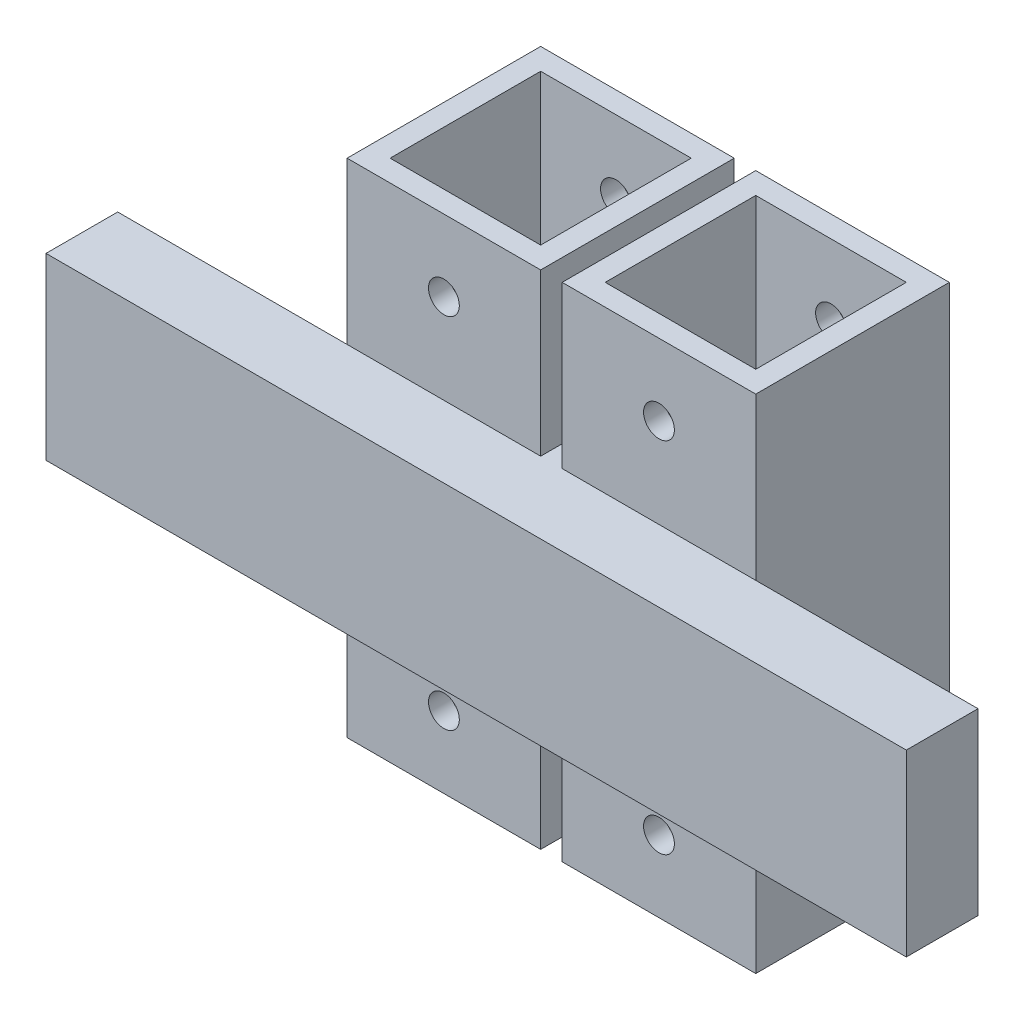
ISO-10303-21;
HEADER;
FILE_DESCRIPTION(('STEP AP214'),'2;1');
FILE_NAME('part.step','',(''),(''),'','','');
FILE_SCHEMA(('AUTOMOTIVE_DESIGN { 1 0 10303 214 1 1 1 1 }'));
ENDSEC;
DATA;
#1=APPLICATION_CONTEXT('core data for automotive mechanical design processes');
#2=APPLICATION_PROTOCOL_DEFINITION('international standard','automotive_design',2000,#1);
#3=PRODUCT_CONTEXT('',#1,'mechanical');
#4=PRODUCT('Part','Part','',(#3));
#5=PRODUCT_RELATED_PRODUCT_CATEGORY('part','',(#4));
#6=PRODUCT_DEFINITION_FORMATION('','',#4);
#7=PRODUCT_DEFINITION_CONTEXT('part definition',#1,'design');
#8=PRODUCT_DEFINITION('design','',#6,#7);
#9=PRODUCT_DEFINITION_SHAPE('','',#8);
#10=(LENGTH_UNIT() NAMED_UNIT(*) SI_UNIT(.MILLI.,.METRE.));
#11=(NAMED_UNIT(*) PLANE_ANGLE_UNIT() SI_UNIT($,.RADIAN.));
#12=(NAMED_UNIT(*) SI_UNIT($,.STERADIAN.) SOLID_ANGLE_UNIT());
#13=UNCERTAINTY_MEASURE_WITH_UNIT(LENGTH_MEASURE(1.E-05),#10,'distance_accuracy_value','');
#14=(GEOMETRIC_REPRESENTATION_CONTEXT(3) GLOBAL_UNCERTAINTY_ASSIGNED_CONTEXT((#13)) GLOBAL_UNIT_ASSIGNED_CONTEXT((#10,
#11,#12)) REPRESENTATION_CONTEXT('',''));
#15=CARTESIAN_POINT('',(0.,0.,0.));
#16=DIRECTION('',(0.,0.,1.));
#17=DIRECTION('',(1.,0.,0.));
#18=AXIS2_PLACEMENT_3D('',#15,#16,#17);
#19=CARTESIAN_POINT('',(0.,70.,0.));
#20=DIRECTION('',(1.,0.,0.));
#21=DIRECTION('',(0.,0.,-1.));
#22=AXIS2_PLACEMENT_3D('',#19,#20,#21);
#23=PLANE('',#22);
#24=DIRECTION('',(0.,-1.,0.));
#25=VECTOR('',#24,1.);
#26=CARTESIAN_POINT('',(0.,70.,0.));
#27=LINE('',#26,#25);
#28=CARTESIAN_POINT('',(0.,22.5,0.));
#29=VERTEX_POINT('',#28);
#30=CARTESIAN_POINT('',(0.,0.,0.));
#31=VERTEX_POINT('',#30);
#32=EDGE_CURVE('E332',#29,#31,#27,.T.);
#33=ORIENTED_EDGE('',*,*,#32,.F.);
#34=DIRECTION('',(0.,0.,-1.));
#35=VECTOR('',#34,1.);
#36=CARTESIAN_POINT('',(0.,22.5,25.1793566240283));
#37=LINE('',#36,#35);
#38=CARTESIAN_POINT('',(0.,22.5,-27.));
#39=VERTEX_POINT('',#38);
#40=EDGE_CURVE('E376',#29,#39,#37,.T.);
#41=ORIENTED_EDGE('',*,*,#40,.T.);
#42=DIRECTION('',(0.,-1.,0.));
#43=VECTOR('',#42,1.);
#44=CARTESIAN_POINT('',(0.,70.,-27.));
#45=LINE('',#44,#43);
#46=CARTESIAN_POINT('',(0.,0.,-27.));
#47=VERTEX_POINT('',#46);
#48=EDGE_CURVE('E312',#39,#47,#45,.T.);
#49=ORIENTED_EDGE('',*,*,#48,.T.);
#50=DIRECTION('',(0.,0.,1.));
#51=VECTOR('',#50,1.);
#52=CARTESIAN_POINT('',(0.,0.,0.));
#53=LINE('',#52,#51);
#54=EDGE_CURVE('E301',#47,#31,#53,.T.);
#55=ORIENTED_EDGE('',*,*,#54,.T.);
#56=EDGE_LOOP('',(#33,#41,#49,#55));
#57=FACE_BOUND('',#56,.T.);
#58=ADVANCED_FACE('F33',(#57),#23,.F.);
#59=CARTESIAN_POINT('',(-3.,70.,-27.));
#60=DIRECTION('',(-1.,0.,0.));
#61=DIRECTION('',(0.,0.,1.));
#62=AXIS2_PLACEMENT_3D('',#59,#60,#61);
#63=PLANE('',#62);
#64=DIRECTION('',(0.,-1.,0.));
#65=VECTOR('',#64,1.);
#66=CARTESIAN_POINT('',(-3.,70.,-27.));
#67=LINE('',#66,#65);
#68=CARTESIAN_POINT('',(-3.,22.5,-27.));
#69=VERTEX_POINT('',#68);
#70=CARTESIAN_POINT('',(-3.,0.,-27.));
#71=VERTEX_POINT('',#70);
#72=EDGE_CURVE('E216',#69,#71,#67,.T.);
#73=ORIENTED_EDGE('',*,*,#72,.F.);
#74=DIRECTION('',(0.,0.,-1.));
#75=VECTOR('',#74,1.);
#76=CARTESIAN_POINT('',(-3.,22.5,25.1793566240283));
#77=LINE('',#76,#75);
#78=CARTESIAN_POINT('',(-3.,22.5,0.));
#79=VERTEX_POINT('',#78);
#80=EDGE_CURVE('E210',#79,#69,#77,.T.);
#81=ORIENTED_EDGE('',*,*,#80,.F.);
#82=DIRECTION('',(0.,-1.,0.));
#83=VECTOR('',#82,1.);
#84=CARTESIAN_POINT('',(-3.,70.,0.));
#85=LINE('',#84,#83);
#86=CARTESIAN_POINT('',(-3.,0.,0.));
#87=VERTEX_POINT('',#86);
#88=EDGE_CURVE('E214',#79,#87,#85,.T.);
#89=ORIENTED_EDGE('',*,*,#88,.T.);
#90=DIRECTION('',(0.,0.,-1.));
#91=VECTOR('',#90,1.);
#92=CARTESIAN_POINT('',(-3.,0.,-27.));
#93=LINE('',#92,#91);
#94=EDGE_CURVE('E427',#87,#71,#93,.T.);
#95=ORIENTED_EDGE('',*,*,#94,.T.);
#96=EDGE_LOOP('',(#73,#81,#89,#95));
#97=FACE_BOUND('',#96,.T.);
#98=ADVANCED_FACE('F212',(#97),#63,.F.);
#99=CARTESIAN_POINT('',(0.,0.,0.));
#100=DIRECTION('',(0.,0.,1.));
#101=DIRECTION('',(1.,0.,0.));
#102=AXIS2_PLACEMENT_3D('',#99,#100,#101);
#103=PLANE('',#102);
#104=DIRECTION('',(0.,-1.,0.));
#105=VECTOR('',#104,1.);
#106=CARTESIAN_POINT('',(-30.,70.,0.));
#107=LINE('',#106,#105);
#108=CARTESIAN_POINT('',(-30.,47.5,0.));
#109=VERTEX_POINT('',#108);
#110=CARTESIAN_POINT('',(-30.,22.5,0.));
#111=VERTEX_POINT('',#110);
#112=EDGE_CURVE('E241',#109,#111,#107,.T.);
#113=ORIENTED_EDGE('',*,*,#112,.T.);
#114=DIRECTION('',(1.,0.,0.));
#115=VECTOR('',#114,1.);
#116=CARTESIAN_POINT('',(-62.,22.5,0.));
#117=LINE('',#116,#115);
#118=CARTESIAN_POINT('',(-62.,22.5,0.));
#119=VERTEX_POINT('',#118);
#120=EDGE_CURVE('E235',#119,#111,#117,.T.);
#121=ORIENTED_EDGE('',*,*,#120,.F.);
#122=DIRECTION('',(0.,-1.,0.));
#123=VECTOR('',#122,1.);
#124=CARTESIAN_POINT('',(-62.,47.5,0.));
#125=LINE('',#124,#123);
#126=CARTESIAN_POINT('',(-62.,47.5,0.));
#127=VERTEX_POINT('',#126);
#128=EDGE_CURVE('E236',#127,#119,#125,.T.);
#129=ORIENTED_EDGE('',*,*,#128,.F.);
#130=DIRECTION('',(-1.,0.,0.));
#131=VECTOR('',#130,1.);
#132=CARTESIAN_POINT('',(-62.,47.5,0.));
#133=LINE('',#132,#131);
#134=EDGE_CURVE('E257',#109,#127,#133,.T.);
#135=ORIENTED_EDGE('',*,*,#134,.F.);
#136=EDGE_LOOP('',(#113,#121,#129,#135));
#137=FACE_BOUND('',#136,.T.);
#138=ADVANCED_FACE('F440',(#137),#103,.F.);
#139=CARTESIAN_POINT('',(0.,70.,0.));
#140=DIRECTION('',(0.,0.,-1.));
#141=DIRECTION('',(-1.,0.,0.));
#142=AXIS2_PLACEMENT_3D('',#139,#140,#141);
#143=PLANE('',#142);
#144=CARTESIAN_POINT('',(13.5,60.,0.));
#145=DIRECTION('',(0.,0.,-1.));
#146=DIRECTION('',(-1.,0.,0.));
#147=AXIS2_PLACEMENT_3D('',#144,#145,#146);
#148=CIRCLE('',#147,2.15);
#149=CARTESIAN_POINT('',(11.35,60.,0.));
#150=VERTEX_POINT('',#149);
#151=EDGE_CURVE('E353',#150,#150,#148,.T.);
#152=ORIENTED_EDGE('',*,*,#151,.T.);
#153=EDGE_LOOP('',(#152));
#154=FACE_BOUND('',#153,.T.);
#155=CARTESIAN_POINT('',(27.,47.5,0.));
#156=VERTEX_POINT('',#155);
#157=CARTESIAN_POINT('',(0.,47.5,0.));
#158=VERTEX_POINT('',#157);
#159=EDGE_CURVE('E11',#156,#158,#133,.T.);
#160=ORIENTED_EDGE('',*,*,#159,.F.);
#161=DIRECTION('',(0.,-1.,0.));
#162=VECTOR('',#161,1.);
#163=CARTESIAN_POINT('',(27.,70.,0.));
#164=LINE('',#163,#162);
#165=CARTESIAN_POINT('',(27.,70.,0.));
#166=VERTEX_POINT('',#165);
#167=EDGE_CURVE('E329',#166,#156,#164,.T.);
#168=ORIENTED_EDGE('',*,*,#167,.F.);
#169=DIRECTION('',(1.,0.,0.));
#170=VECTOR('',#169,1.);
#171=CARTESIAN_POINT('',(0.,70.,0.));
#172=LINE('',#171,#170);
#173=CARTESIAN_POINT('',(0.,70.,0.));
#174=VERTEX_POINT('',#173);
#175=EDGE_CURVE('E305',#174,#166,#172,.T.);
#176=ORIENTED_EDGE('',*,*,#175,.F.);
#177=EDGE_CURVE('E334',#174,#158,#27,.T.);
#178=ORIENTED_EDGE('',*,*,#177,.T.);
#179=EDGE_LOOP('',(#160,#168,#176,#178));
#180=FACE_BOUND('',#179,.T.);
#181=ADVANCED_FACE('F539',(#154,#180),#143,.F.);
#182=CARTESIAN_POINT('',(13.5,10.,0.));
#183=DIRECTION('',(0.,0.,-1.));
#184=DIRECTION('',(-1.,0.,0.));
#185=AXIS2_PLACEMENT_3D('',#182,#183,#184);
#186=CIRCLE('',#185,2.15);
#187=CARTESIAN_POINT('',(11.35,10.,0.));
#188=VERTEX_POINT('',#187);
#189=EDGE_CURVE('E368',#188,#188,#186,.T.);
#190=ORIENTED_EDGE('',*,*,#189,.T.);
#191=EDGE_LOOP('',(#190));
#192=FACE_BOUND('',#191,.T.);
#193=CARTESIAN_POINT('',(27.,22.5,0.));
#194=VERTEX_POINT('',#193);
#195=EDGE_CURVE('E42',#29,#194,#117,.T.);
#196=ORIENTED_EDGE('',*,*,#195,.F.);
#197=ORIENTED_EDGE('',*,*,#32,.T.);
#198=DIRECTION('',(1.,0.,0.));
#199=VECTOR('',#198,1.);
#200=CARTESIAN_POINT('',(0.,0.,0.));
#201=LINE('',#200,#199);
#202=CARTESIAN_POINT('',(27.,0.,0.));
#203=VERTEX_POINT('',#202);
#204=EDGE_CURVE('E315',#31,#203,#201,.T.);
#205=ORIENTED_EDGE('',*,*,#204,.T.);
#206=EDGE_CURVE('E328',#194,#203,#164,.T.);
#207=ORIENTED_EDGE('',*,*,#206,.F.);
#208=EDGE_LOOP('',(#196,#197,#205,#207));
#209=FACE_BOUND('',#208,.T.);
#210=ADVANCED_FACE('F485',(#192,#209),#143,.F.);
#211=CARTESIAN_POINT('',(0.,70.,0.));
#212=DIRECTION('',(0.,-1.,0.));
#213=DIRECTION('',(0.,0.,-1.));
#214=AXIS2_PLACEMENT_3D('',#211,#212,#213);
#215=PLANE('',#214);
#216=DIRECTION('',(0.,0.,1.));
#217=VECTOR('',#216,1.);
#218=CARTESIAN_POINT('',(0.,70.,0.));
#219=LINE('',#218,#217);
#220=CARTESIAN_POINT('',(0.,70.,-27.));
#221=VERTEX_POINT('',#220);
#222=EDGE_CURVE('E302',#221,#174,#219,.T.);
#223=ORIENTED_EDGE('',*,*,#222,.T.);
#224=ORIENTED_EDGE('',*,*,#175,.T.);
#225=DIRECTION('',(0.,0.,-1.));
#226=VECTOR('',#225,1.);
#227=CARTESIAN_POINT('',(27.,70.,0.));
#228=LINE('',#227,#226);
#229=CARTESIAN_POINT('',(27.,70.,-27.));
#230=VERTEX_POINT('',#229);
#231=EDGE_CURVE('E308',#166,#230,#228,.T.);
#232=ORIENTED_EDGE('',*,*,#231,.T.);
#233=DIRECTION('',(-1.,0.,0.));
#234=VECTOR('',#233,1.);
#235=CARTESIAN_POINT('',(0.,70.,-27.));
#236=LINE('',#235,#234);
#237=EDGE_CURVE('E310',#230,#221,#236,.T.);
#238=ORIENTED_EDGE('',*,*,#237,.T.);
#239=EDGE_LOOP('',(#223,#224,#232,#238));
#240=FACE_BOUND('',#239,.T.);
#241=DIRECTION('',(0.,0.,1.));
#242=VECTOR('',#241,1.);
#243=CARTESIAN_POINT('',(3.,70.,-24.));
#244=LINE('',#243,#242);
#245=CARTESIAN_POINT('',(3.,70.,-24.));
#246=VERTEX_POINT('',#245);
#247=CARTESIAN_POINT('',(3.,70.,-3.));
#248=VERTEX_POINT('',#247);
#249=EDGE_CURVE('E271',#246,#248,#244,.T.);
#250=ORIENTED_EDGE('',*,*,#249,.F.);
#251=DIRECTION('',(-1.,0.,0.));
#252=VECTOR('',#251,1.);
#253=CARTESIAN_POINT('',(3.,70.,-24.));
#254=LINE('',#253,#252);
#255=CARTESIAN_POINT('',(24.,70.,-24.));
#256=VERTEX_POINT('',#255);
#257=EDGE_CURVE('E279',#256,#246,#254,.T.);
#258=ORIENTED_EDGE('',*,*,#257,.F.);
#259=DIRECTION('',(0.,0.,-1.));
#260=VECTOR('',#259,1.);
#261=CARTESIAN_POINT('',(24.,70.,-24.));
#262=LINE('',#261,#260);
#263=CARTESIAN_POINT('',(24.,70.,-3.00000000000001));
#264=VERTEX_POINT('',#263);
#265=EDGE_CURVE('E276',#264,#256,#262,.T.);
#266=ORIENTED_EDGE('',*,*,#265,.F.);
#267=DIRECTION('',(1.,0.,0.));
#268=VECTOR('',#267,1.);
#269=CARTESIAN_POINT('',(3.,70.,-3.));
#270=LINE('',#269,#268);
#271=EDGE_CURVE('E273',#248,#264,#270,.T.);
#272=ORIENTED_EDGE('',*,*,#271,.F.);
#273=EDGE_LOOP('',(#250,#258,#266,#272));
#274=FACE_BOUND('',#273,.T.);
#275=ADVANCED_FACE('F466',(#240,#274),#215,.F.);
#276=CARTESIAN_POINT('',(0.,0.,0.));
#277=DIRECTION('',(0.,-1.,0.));
#278=DIRECTION('',(0.,0.,-1.));
#279=AXIS2_PLACEMENT_3D('',#276,#277,#278);
#280=PLANE('',#279);
#281=ORIENTED_EDGE('',*,*,#54,.F.);
#282=DIRECTION('',(-1.,0.,0.));
#283=VECTOR('',#282,1.);
#284=CARTESIAN_POINT('',(0.,0.,-27.));
#285=LINE('',#284,#283);
#286=CARTESIAN_POINT('',(27.,0.,-27.));
#287=VERTEX_POINT('',#286);
#288=EDGE_CURVE('E306',#287,#47,#285,.T.);
#289=ORIENTED_EDGE('',*,*,#288,.F.);
#290=DIRECTION('',(0.,0.,-1.));
#291=VECTOR('',#290,1.);
#292=CARTESIAN_POINT('',(27.,0.,0.));
#293=LINE('',#292,#291);
#294=EDGE_CURVE('E318',#203,#287,#293,.T.);
#295=ORIENTED_EDGE('',*,*,#294,.F.);
#296=ORIENTED_EDGE('',*,*,#204,.F.);
#297=EDGE_LOOP('',(#281,#289,#295,#296));
#298=FACE_BOUND('',#297,.T.);
#299=DIRECTION('',(-1.,0.,0.));
#300=VECTOR('',#299,1.);
#301=CARTESIAN_POINT('',(3.,0.,-24.));
#302=LINE('',#301,#300);
#303=CARTESIAN_POINT('',(24.,0.,-24.));
#304=VERTEX_POINT('',#303);
#305=CARTESIAN_POINT('',(3.,0.,-24.));
#306=VERTEX_POINT('',#305);
#307=EDGE_CURVE('E274',#304,#306,#302,.T.);
#308=ORIENTED_EDGE('',*,*,#307,.T.);
#309=DIRECTION('',(0.,0.,1.));
#310=VECTOR('',#309,1.);
#311=CARTESIAN_POINT('',(3.,0.,-24.));
#312=LINE('',#311,#310);
#313=CARTESIAN_POINT('',(3.,0.,-3.));
#314=VERTEX_POINT('',#313);
#315=EDGE_CURVE('E270',#306,#314,#312,.T.);
#316=ORIENTED_EDGE('',*,*,#315,.T.);
#317=DIRECTION('',(1.,0.,0.));
#318=VECTOR('',#317,1.);
#319=CARTESIAN_POINT('',(3.,0.,-3.));
#320=LINE('',#319,#318);
#321=CARTESIAN_POINT('',(24.,0.,-3.00000000000001));
#322=VERTEX_POINT('',#321);
#323=EDGE_CURVE('E284',#314,#322,#320,.T.);
#324=ORIENTED_EDGE('',*,*,#323,.T.);
#325=DIRECTION('',(0.,0.,-1.));
#326=VECTOR('',#325,1.);
#327=CARTESIAN_POINT('',(24.,0.,-24.));
#328=LINE('',#327,#326);
#329=EDGE_CURVE('E287',#322,#304,#328,.T.);
#330=ORIENTED_EDGE('',*,*,#329,.T.);
#331=EDGE_LOOP('',(#308,#316,#324,#330));
#332=FACE_BOUND('',#331,.T.);
#333=ADVANCED_FACE('F476',(#298,#332),#280,.T.);
#334=CARTESIAN_POINT('',(0.,47.5,-27.));
#335=VERTEX_POINT('',#334);
#336=EDGE_CURVE('E322',#221,#335,#45,.T.);
#337=ORIENTED_EDGE('',*,*,#336,.T.);
#338=DIRECTION('',(0.,0.,-1.));
#339=VECTOR('',#338,1.);
#340=CARTESIAN_POINT('',(0.,47.5,25.1793566240283));
#341=LINE('',#340,#339);
#342=EDGE_CURVE('E374',#158,#335,#341,.T.);
#343=ORIENTED_EDGE('',*,*,#342,.F.);
#344=ORIENTED_EDGE('',*,*,#177,.F.);
#345=ORIENTED_EDGE('',*,*,#222,.F.);
#346=EDGE_LOOP('',(#337,#343,#344,#345));
#347=FACE_BOUND('',#346,.T.);
#348=ADVANCED_FACE('F35',(#347),#23,.F.);
#349=CARTESIAN_POINT('',(27.,70.,0.));
#350=DIRECTION('',(-1.,0.,0.));
#351=DIRECTION('',(0.,0.,1.));
#352=AXIS2_PLACEMENT_3D('',#349,#350,#351);
#353=PLANE('',#352);
#354=ORIENTED_EDGE('',*,*,#294,.T.);
#355=DIRECTION('',(0.,-1.,0.));
#356=VECTOR('',#355,1.);
#357=CARTESIAN_POINT('',(27.,70.,-27.));
#358=LINE('',#357,#356);
#359=EDGE_CURVE('E325',#230,#287,#358,.T.);
#360=ORIENTED_EDGE('',*,*,#359,.F.);
#361=ORIENTED_EDGE('',*,*,#231,.F.);
#362=ORIENTED_EDGE('',*,*,#167,.T.);
#363=EDGE_CURVE('E333',#156,#194,#164,.T.);
#364=ORIENTED_EDGE('',*,*,#363,.T.);
#365=ORIENTED_EDGE('',*,*,#206,.T.);
#366=EDGE_LOOP('',(#354,#360,#361,#362,#364,#365));
#367=FACE_BOUND('',#366,.T.);
#368=ADVANCED_FACE('F523',(#367),#353,.F.);
#369=CARTESIAN_POINT('',(0.,70.,-27.));
#370=DIRECTION('',(0.,0.,1.));
#371=DIRECTION('',(1.,0.,0.));
#372=AXIS2_PLACEMENT_3D('',#369,#370,#371);
#373=PLANE('',#372);
#374=CARTESIAN_POINT('',(-16.5,60.,-27.));
#375=DIRECTION('',(0.,0.,-1.));
#376=DIRECTION('',(-1.,0.,0.));
#377=AXIS2_PLACEMENT_3D('',#374,#375,#376);
#378=CIRCLE('',#377,2.14999999999999);
#379=CARTESIAN_POINT('',(-18.65,60.,-27.));
#380=VERTEX_POINT('',#379);
#381=EDGE_CURVE('E579',#380,#380,#378,.T.);
#382=ORIENTED_EDGE('',*,*,#381,.F.);
#383=EDGE_LOOP('',(#382));
#384=FACE_BOUND('',#383,.T.);
#385=CARTESIAN_POINT('',(13.5,10.,-27.));
#386=DIRECTION('',(0.,0.,-1.));
#387=DIRECTION('',(-1.,0.,0.));
#388=AXIS2_PLACEMENT_3D('',#385,#386,#387);
#389=CIRCLE('',#388,2.15);
#390=CARTESIAN_POINT('',(11.35,10.,-27.));
#391=VERTEX_POINT('',#390);
#392=EDGE_CURVE('E582',#391,#391,#389,.T.);
#393=ORIENTED_EDGE('',*,*,#392,.F.);
#394=EDGE_LOOP('',(#393));
#395=FACE_BOUND('',#394,.T.);
#396=CARTESIAN_POINT('',(-16.5,10.,-27.));
#397=DIRECTION('',(0.,0.,-1.));
#398=DIRECTION('',(-1.,0.,0.));
#399=AXIS2_PLACEMENT_3D('',#396,#397,#398);
#400=CIRCLE('',#399,2.15);
#401=CARTESIAN_POINT('',(-18.65,10.,-27.));
#402=VERTEX_POINT('',#401);
#403=EDGE_CURVE('E611',#402,#402,#400,.T.);
#404=ORIENTED_EDGE('',*,*,#403,.F.);
#405=EDGE_LOOP('',(#404));
#406=FACE_BOUND('',#405,.T.);
#407=CARTESIAN_POINT('',(13.5,60.,-27.));
#408=DIRECTION('',(0.,0.,-1.));
#409=DIRECTION('',(-1.,0.,0.));
#410=AXIS2_PLACEMENT_3D('',#407,#408,#409);
#411=CIRCLE('',#410,2.15);
#412=CARTESIAN_POINT('',(11.35,60.,-27.));
#413=VERTEX_POINT('',#412);
#414=EDGE_CURVE('E341',#413,#413,#411,.T.);
#415=ORIENTED_EDGE('',*,*,#414,.F.);
#416=EDGE_LOOP('',(#415));
#417=FACE_BOUND('',#416,.T.);
#418=ORIENTED_EDGE('',*,*,#288,.T.);
#419=ORIENTED_EDGE('',*,*,#48,.F.);
#420=DIRECTION('',(-1.,0.,0.));
#421=VECTOR('',#420,1.);
#422=CARTESIAN_POINT('',(0.,22.5,-27.));
#423=LINE('',#422,#421);
#424=EDGE_CURVE('E52',#39,#69,#423,.T.);
#425=ORIENTED_EDGE('',*,*,#424,.T.);
#426=ORIENTED_EDGE('',*,*,#72,.T.);
#427=DIRECTION('',(-1.,0.,0.));
#428=VECTOR('',#427,1.);
#429=CARTESIAN_POINT('',(-30.,0.,-27.));
#430=LINE('',#429,#428);
#431=CARTESIAN_POINT('',(-30.,0.,-27.));
#432=VERTEX_POINT('',#431);
#433=EDGE_CURVE('E417',#71,#432,#430,.T.);
#434=ORIENTED_EDGE('',*,*,#433,.T.);
#435=DIRECTION('',(0.,-1.,0.));
#436=VECTOR('',#435,1.);
#437=CARTESIAN_POINT('',(-30.,70.,-27.));
#438=LINE('',#437,#436);
#439=CARTESIAN_POINT('',(-30.,70.,-27.));
#440=VERTEX_POINT('',#439);
#441=EDGE_CURVE('E423',#440,#432,#438,.T.);
#442=ORIENTED_EDGE('',*,*,#441,.F.);
#443=DIRECTION('',(-1.,0.,0.));
#444=VECTOR('',#443,1.);
#445=CARTESIAN_POINT('',(-30.,70.,-27.));
#446=LINE('',#445,#444);
#447=CARTESIAN_POINT('',(-3.,70.,-27.));
#448=VERTEX_POINT('',#447);
#449=EDGE_CURVE('E421',#448,#440,#446,.T.);
#450=ORIENTED_EDGE('',*,*,#449,.F.);
#451=CARTESIAN_POINT('',(-3.,47.5,-27.));
#452=VERTEX_POINT('',#451);
#453=EDGE_CURVE('E230',#448,#452,#67,.T.);
#454=ORIENTED_EDGE('',*,*,#453,.T.);
#455=DIRECTION('',(1.,0.,0.));
#456=VECTOR('',#455,1.);
#457=CARTESIAN_POINT('',(0.,47.5,-27.));
#458=LINE('',#457,#456);
#459=EDGE_CURVE('E220',#452,#335,#458,.T.);
#460=ORIENTED_EDGE('',*,*,#459,.T.);
#461=ORIENTED_EDGE('',*,*,#336,.F.);
#462=ORIENTED_EDGE('',*,*,#237,.F.);
#463=ORIENTED_EDGE('',*,*,#359,.T.);
#464=EDGE_LOOP('',(#418,#419,#425,#426,#434,#442,#450,#454,#460,#461,#462,#463));
#465=FACE_BOUND('',#464,.T.);
#466=ADVANCED_FACE('F452',(#384,#395,#406,#417,#465),#373,.F.);
#467=CARTESIAN_POINT('',(3.,70.,-24.));
#468=DIRECTION('',(1.,0.,0.));
#469=DIRECTION('',(0.,0.,-1.));
#470=AXIS2_PLACEMENT_3D('',#467,#468,#469);
#471=PLANE('',#470);
#472=ORIENTED_EDGE('',*,*,#315,.F.);
#473=DIRECTION('',(0.,-1.,0.));
#474=VECTOR('',#473,1.);
#475=CARTESIAN_POINT('',(3.,70.,-24.));
#476=LINE('',#475,#474);
#477=EDGE_CURVE('E281',#246,#306,#476,.T.);
#478=ORIENTED_EDGE('',*,*,#477,.F.);
#479=ORIENTED_EDGE('',*,*,#249,.T.);
#480=DIRECTION('',(0.,-1.,0.));
#481=VECTOR('',#480,1.);
#482=CARTESIAN_POINT('',(3.,70.,-3.));
#483=LINE('',#482,#481);
#484=EDGE_CURVE('E298',#248,#314,#483,.T.);
#485=ORIENTED_EDGE('',*,*,#484,.T.);
#486=EDGE_LOOP('',(#472,#478,#479,#485));
#487=FACE_BOUND('',#486,.T.);
#488=ADVANCED_FACE('F537',(#487),#471,.T.);
#489=CARTESIAN_POINT('',(3.,70.,-3.));
#490=DIRECTION('',(0.,0.,-1.));
#491=DIRECTION('',(-1.,0.,0.));
#492=AXIS2_PLACEMENT_3D('',#489,#490,#491);
#493=PLANE('',#492);
#494=CARTESIAN_POINT('',(13.5,10.,-3.00000000000001));
#495=DIRECTION('',(0.,0.,-1.));
#496=DIRECTION('',(-1.,0.,0.));
#497=AXIS2_PLACEMENT_3D('',#494,#495,#496);
#498=CIRCLE('',#497,2.15);
#499=CARTESIAN_POINT('',(11.35,10.,-3.00000000000001));
#500=VERTEX_POINT('',#499);
#501=EDGE_CURVE('E365',#500,#500,#498,.T.);
#502=ORIENTED_EDGE('',*,*,#501,.F.);
#503=EDGE_LOOP('',(#502));
#504=FACE_BOUND('',#503,.T.);
#505=CARTESIAN_POINT('',(13.5,60.,-3.00000000000001));
#506=DIRECTION('',(0.,0.,-1.));
#507=DIRECTION('',(-1.,0.,0.));
#508=AXIS2_PLACEMENT_3D('',#505,#506,#507);
#509=CIRCLE('',#508,2.15);
#510=CARTESIAN_POINT('',(11.35,60.,-3.00000000000001));
#511=VERTEX_POINT('',#510);
#512=EDGE_CURVE('E348',#511,#511,#509,.T.);
#513=ORIENTED_EDGE('',*,*,#512,.F.);
#514=EDGE_LOOP('',(#513));
#515=FACE_BOUND('',#514,.T.);
#516=ORIENTED_EDGE('',*,*,#323,.F.);
#517=ORIENTED_EDGE('',*,*,#484,.F.);
#518=ORIENTED_EDGE('',*,*,#271,.T.);
#519=DIRECTION('',(0.,-1.,0.));
#520=VECTOR('',#519,1.);
#521=CARTESIAN_POINT('',(24.,70.,-3.00000000000001));
#522=LINE('',#521,#520);
#523=EDGE_CURVE('E296',#264,#322,#522,.T.);
#524=ORIENTED_EDGE('',*,*,#523,.T.);
#525=EDGE_LOOP('',(#516,#517,#518,#524));
#526=FACE_BOUND('',#525,.T.);
#527=ADVANCED_FACE('F791',(#504,#515,#526),#493,.T.);
#528=CARTESIAN_POINT('',(24.,70.,-24.));
#529=DIRECTION('',(-1.,0.,0.));
#530=DIRECTION('',(0.,0.,1.));
#531=AXIS2_PLACEMENT_3D('',#528,#529,#530);
#532=PLANE('',#531);
#533=ORIENTED_EDGE('',*,*,#329,.F.);
#534=ORIENTED_EDGE('',*,*,#523,.F.);
#535=ORIENTED_EDGE('',*,*,#265,.T.);
#536=DIRECTION('',(0.,-1.,0.));
#537=VECTOR('',#536,1.);
#538=CARTESIAN_POINT('',(24.,70.,-24.));
#539=LINE('',#538,#537);
#540=EDGE_CURVE('E294',#256,#304,#539,.T.);
#541=ORIENTED_EDGE('',*,*,#540,.T.);
#542=EDGE_LOOP('',(#533,#534,#535,#541));
#543=FACE_BOUND('',#542,.T.);
#544=ADVANCED_FACE('F514',(#543),#532,.T.);
#545=CARTESIAN_POINT('',(3.,70.,-24.));
#546=DIRECTION('',(0.,0.,1.));
#547=DIRECTION('',(1.,0.,0.));
#548=AXIS2_PLACEMENT_3D('',#545,#546,#547);
#549=PLANE('',#548);
#550=CARTESIAN_POINT('',(13.5,10.,-24.));
#551=DIRECTION('',(0.,0.,1.));
#552=DIRECTION('',(1.,0.,0.));
#553=AXIS2_PLACEMENT_3D('',#550,#551,#552);
#554=CIRCLE('',#553,2.15);
#555=CARTESIAN_POINT('',(15.65,10.,-24.));
#556=VERTEX_POINT('',#555);
#557=EDGE_CURVE('E37',#556,#556,#554,.T.);
#558=ORIENTED_EDGE('',*,*,#557,.F.);
#559=EDGE_LOOP('',(#558));
#560=FACE_BOUND('',#559,.T.);
#561=CARTESIAN_POINT('',(13.5,60.,-24.));
#562=DIRECTION('',(0.,0.,1.));
#563=DIRECTION('',(1.,0.,0.));
#564=AXIS2_PLACEMENT_3D('',#561,#562,#563);
#565=CIRCLE('',#564,2.15);
#566=CARTESIAN_POINT('',(15.65,60.,-24.));
#567=VERTEX_POINT('',#566);
#568=EDGE_CURVE('E346',#567,#567,#565,.T.);
#569=ORIENTED_EDGE('',*,*,#568,.F.);
#570=EDGE_LOOP('',(#569));
#571=FACE_BOUND('',#570,.T.);
#572=ORIENTED_EDGE('',*,*,#307,.F.);
#573=ORIENTED_EDGE('',*,*,#540,.F.);
#574=ORIENTED_EDGE('',*,*,#257,.T.);
#575=ORIENTED_EDGE('',*,*,#477,.T.);
#576=EDGE_LOOP('',(#572,#573,#574,#575));
#577=FACE_BOUND('',#576,.T.);
#578=ADVANCED_FACE('F507',(#560,#571,#577),#549,.T.);
#579=CARTESIAN_POINT('',(-62.,47.5,10.));
#580=DIRECTION('',(1.,0.,0.));
#581=DIRECTION('',(0.,0.,-1.));
#582=AXIS2_PLACEMENT_3D('',#579,#580,#581);
#583=PLANE('',#582);
#584=ORIENTED_EDGE('',*,*,#128,.T.);
#585=DIRECTION('',(0.,0.,-1.));
#586=VECTOR('',#585,1.);
#587=CARTESIAN_POINT('',(-62.,22.5,10.));
#588=LINE('',#587,#586);
#589=CARTESIAN_POINT('',(-62.,22.5,10.));
#590=VERTEX_POINT('',#589);
#591=EDGE_CURVE('E268',#590,#119,#588,.T.);
#592=ORIENTED_EDGE('',*,*,#591,.F.);
#593=DIRECTION('',(0.,-1.,0.));
#594=VECTOR('',#593,1.);
#595=CARTESIAN_POINT('',(-62.,47.5,10.));
#596=LINE('',#595,#594);
#597=CARTESIAN_POINT('',(-62.,47.5,10.));
#598=VERTEX_POINT('',#597);
#599=EDGE_CURVE('E245',#598,#590,#596,.T.);
#600=ORIENTED_EDGE('',*,*,#599,.F.);
#601=DIRECTION('',(0.,0.,-1.));
#602=VECTOR('',#601,1.);
#603=CARTESIAN_POINT('',(-62.,47.5,10.));
#604=LINE('',#603,#602);
#605=EDGE_CURVE('E253',#598,#127,#604,.T.);
#606=ORIENTED_EDGE('',*,*,#605,.T.);
#607=EDGE_LOOP('',(#584,#592,#600,#606));
#608=FACE_BOUND('',#607,.T.);
#609=ADVANCED_FACE('F505',(#608),#583,.F.);
#610=CARTESIAN_POINT('',(-62.,22.5,10.));
#611=DIRECTION('',(0.,1.,0.));
#612=DIRECTION('',(0.,0.,1.));
#613=AXIS2_PLACEMENT_3D('',#610,#611,#612);
#614=PLANE('',#613);
#615=ORIENTED_EDGE('',*,*,#120,.T.);
#616=DIRECTION('',(-1.,0.,0.));
#617=VECTOR('',#616,1.);
#618=CARTESIAN_POINT('',(-62.,22.5,0.));
#619=LINE('',#618,#617);
#620=EDGE_CURVE('E224',#79,#111,#619,.T.);
#621=ORIENTED_EDGE('',*,*,#620,.F.);
#622=ORIENTED_EDGE('',*,*,#80,.T.);
#623=ORIENTED_EDGE('',*,*,#424,.F.);
#624=ORIENTED_EDGE('',*,*,#40,.F.);
#625=ORIENTED_EDGE('',*,*,#195,.T.);
#626=CARTESIAN_POINT('',(58.,22.5,0.));
#627=VERTEX_POINT('',#626);
#628=EDGE_CURVE('E239',#194,#627,#117,.T.);
#629=ORIENTED_EDGE('',*,*,#628,.T.);
#630=DIRECTION('',(0.,0.,-1.));
#631=VECTOR('',#630,1.);
#632=CARTESIAN_POINT('',(58.,22.5,10.));
#633=LINE('',#632,#631);
#634=CARTESIAN_POINT('',(58.,22.5,10.));
#635=VERTEX_POINT('',#634);
#636=EDGE_CURVE('E265',#635,#627,#633,.T.);
#637=ORIENTED_EDGE('',*,*,#636,.F.);
#638=DIRECTION('',(1.,0.,0.));
#639=VECTOR('',#638,1.);
#640=CARTESIAN_POINT('',(-62.,22.5,10.));
#641=LINE('',#640,#639);
#642=EDGE_CURVE('E248',#590,#635,#641,.T.);
#643=ORIENTED_EDGE('',*,*,#642,.F.);
#644=ORIENTED_EDGE('',*,*,#591,.T.);
#645=EDGE_LOOP('',(#615,#621,#622,#623,#624,#625,#629,#637,#643,#644));
#646=FACE_BOUND('',#645,.T.);
#647=ADVANCED_FACE('F233',(#646),#614,.F.);
#648=CARTESIAN_POINT('',(58.,47.5,10.));
#649=DIRECTION('',(-1.,0.,0.));
#650=DIRECTION('',(0.,0.,1.));
#651=AXIS2_PLACEMENT_3D('',#648,#649,#650);
#652=PLANE('',#651);
#653=DIRECTION('',(0.,1.,0.));
#654=VECTOR('',#653,1.);
#655=CARTESIAN_POINT('',(58.,47.5,0.));
#656=LINE('',#655,#654);
#657=CARTESIAN_POINT('',(58.,47.5,0.));
#658=VERTEX_POINT('',#657);
#659=EDGE_CURVE('E256',#627,#658,#656,.T.);
#660=ORIENTED_EDGE('',*,*,#659,.T.);
#661=DIRECTION('',(0.,0.,-1.));
#662=VECTOR('',#661,1.);
#663=CARTESIAN_POINT('',(58.,47.5,10.));
#664=LINE('',#663,#662);
#665=CARTESIAN_POINT('',(58.,47.5,10.));
#666=VERTEX_POINT('',#665);
#667=EDGE_CURVE('E262',#666,#658,#664,.T.);
#668=ORIENTED_EDGE('',*,*,#667,.F.);
#669=DIRECTION('',(0.,1.,0.));
#670=VECTOR('',#669,1.);
#671=CARTESIAN_POINT('',(58.,47.5,10.));
#672=LINE('',#671,#670);
#673=EDGE_CURVE('E250',#635,#666,#672,.T.);
#674=ORIENTED_EDGE('',*,*,#673,.F.);
#675=ORIENTED_EDGE('',*,*,#636,.T.);
#676=EDGE_LOOP('',(#660,#668,#674,#675));
#677=FACE_BOUND('',#676,.T.);
#678=ADVANCED_FACE('F493',(#677),#652,.F.);
#679=CARTESIAN_POINT('',(-62.,47.5,10.));
#680=DIRECTION('',(0.,-1.,0.));
#681=DIRECTION('',(0.,0.,-1.));
#682=AXIS2_PLACEMENT_3D('',#679,#680,#681);
#683=PLANE('',#682);
#684=EDGE_CURVE('E44',#658,#156,#133,.T.);
#685=ORIENTED_EDGE('',*,*,#684,.T.);
#686=ORIENTED_EDGE('',*,*,#159,.T.);
#687=ORIENTED_EDGE('',*,*,#342,.T.);
#688=ORIENTED_EDGE('',*,*,#459,.F.);
#689=DIRECTION('',(0.,0.,-1.));
#690=VECTOR('',#689,1.);
#691=CARTESIAN_POINT('',(-3.,47.5,25.1793566240283));
#692=LINE('',#691,#690);
#693=CARTESIAN_POINT('',(-3.,47.5,0.));
#694=VERTEX_POINT('',#693);
#695=EDGE_CURVE('E219',#694,#452,#692,.T.);
#696=ORIENTED_EDGE('',*,*,#695,.F.);
#697=EDGE_CURVE('E45',#694,#109,#133,.T.);
#698=ORIENTED_EDGE('',*,*,#697,.T.);
#699=ORIENTED_EDGE('',*,*,#134,.T.);
#700=ORIENTED_EDGE('',*,*,#605,.F.);
#701=DIRECTION('',(-1.,0.,0.));
#702=VECTOR('',#701,1.);
#703=CARTESIAN_POINT('',(-62.,47.5,10.));
#704=LINE('',#703,#702);
#705=EDGE_CURVE('E252',#666,#598,#704,.T.);
#706=ORIENTED_EDGE('',*,*,#705,.F.);
#707=ORIENTED_EDGE('',*,*,#667,.T.);
#708=EDGE_LOOP('',(#685,#686,#687,#688,#696,#698,#699,#700,#706,#707));
#709=FACE_BOUND('',#708,.T.);
#710=ADVANCED_FACE('F497',(#709),#683,.F.);
#711=CARTESIAN_POINT('',(0.,0.,10.));
#712=DIRECTION('',(0.,0.,1.));
#713=DIRECTION('',(1.,0.,0.));
#714=AXIS2_PLACEMENT_3D('',#711,#712,#713);
#715=PLANE('',#714);
#716=ORIENTED_EDGE('',*,*,#599,.T.);
#717=ORIENTED_EDGE('',*,*,#642,.T.);
#718=ORIENTED_EDGE('',*,*,#673,.T.);
#719=ORIENTED_EDGE('',*,*,#705,.T.);
#720=EDGE_LOOP('',(#716,#717,#718,#719));
#721=FACE_BOUND('',#720,.T.);
#722=ADVANCED_FACE('F502',(#721),#715,.T.);
#723=ORIENTED_EDGE('',*,*,#363,.F.);
#724=ORIENTED_EDGE('',*,*,#684,.F.);
#725=ORIENTED_EDGE('',*,*,#659,.F.);
#726=ORIENTED_EDGE('',*,*,#628,.F.);
#727=EDGE_LOOP('',(#723,#724,#725,#726));
#728=FACE_BOUND('',#727,.T.);
#729=ADVANCED_FACE('F496',(#728),#103,.F.);
#730=CARTESIAN_POINT('',(-30.,70.,0.));
#731=DIRECTION('',(0.,0.,-1.));
#732=DIRECTION('',(-1.,0.,0.));
#733=AXIS2_PLACEMENT_3D('',#730,#731,#732);
#734=PLANE('',#733);
#735=CARTESIAN_POINT('',(-16.5,10.,0.));
#736=DIRECTION('',(0.,0.,-1.));
#737=DIRECTION('',(-1.,0.,0.));
#738=AXIS2_PLACEMENT_3D('',#735,#736,#737);
#739=CIRCLE('',#738,2.15);
#740=CARTESIAN_POINT('',(-18.65,10.,0.));
#741=VERTEX_POINT('',#740);
#742=EDGE_CURVE('E345',#741,#741,#739,.T.);
#743=ORIENTED_EDGE('',*,*,#742,.T.);
#744=EDGE_LOOP('',(#743));
#745=FACE_BOUND('',#744,.T.);
#746=ORIENTED_EDGE('',*,*,#88,.F.);
#747=ORIENTED_EDGE('',*,*,#620,.T.);
#748=CARTESIAN_POINT('',(-30.,0.,0.));
#749=VERTEX_POINT('',#748);
#750=EDGE_CURVE('E243',#111,#749,#107,.T.);
#751=ORIENTED_EDGE('',*,*,#750,.T.);
#752=DIRECTION('',(1.,0.,0.));
#753=VECTOR('',#752,1.);
#754=CARTESIAN_POINT('',(-30.,0.,0.));
#755=LINE('',#754,#753);
#756=EDGE_CURVE('E227',#749,#87,#755,.T.);
#757=ORIENTED_EDGE('',*,*,#756,.T.);
#758=EDGE_LOOP('',(#746,#747,#751,#757));
#759=FACE_BOUND('',#758,.T.);
#760=ADVANCED_FACE('F223',(#745,#759),#734,.F.);
#761=CARTESIAN_POINT('',(-16.5,60.,0.));
#762=DIRECTION('',(0.,0.,-1.));
#763=DIRECTION('',(-1.,0.,0.));
#764=AXIS2_PLACEMENT_3D('',#761,#762,#763);
#765=CIRCLE('',#764,2.14999999999999);
#766=CARTESIAN_POINT('',(-18.65,60.,0.));
#767=VERTEX_POINT('',#766);
#768=EDGE_CURVE('E349',#767,#767,#765,.T.);
#769=ORIENTED_EDGE('',*,*,#768,.T.);
#770=EDGE_LOOP('',(#769));
#771=FACE_BOUND('',#770,.T.);
#772=CARTESIAN_POINT('',(-30.,70.,0.));
#773=VERTEX_POINT('',#772);
#774=EDGE_CURVE('E60',#773,#109,#107,.T.);
#775=ORIENTED_EDGE('',*,*,#774,.T.);
#776=ORIENTED_EDGE('',*,*,#697,.F.);
#777=CARTESIAN_POINT('',(-3.,70.,0.));
#778=VERTEX_POINT('',#777);
#779=EDGE_CURVE('E229',#778,#694,#85,.T.);
#780=ORIENTED_EDGE('',*,*,#779,.F.);
#781=DIRECTION('',(1.,0.,0.));
#782=VECTOR('',#781,1.);
#783=CARTESIAN_POINT('',(-30.,70.,0.));
#784=LINE('',#783,#782);
#785=EDGE_CURVE('E416',#773,#778,#784,.T.);
#786=ORIENTED_EDGE('',*,*,#785,.F.);
#787=EDGE_LOOP('',(#775,#776,#780,#786));
#788=FACE_BOUND('',#787,.T.);
#789=ADVANCED_FACE('F646',(#771,#788),#734,.F.);
#790=CARTESIAN_POINT('',(0.,70.,0.));
#791=DIRECTION('',(0.,1.,0.));
#792=DIRECTION('',(0.,0.,1.));
#793=AXIS2_PLACEMENT_3D('',#790,#791,#792);
#794=PLANE('',#793);
#795=DIRECTION('',(0.,0.,1.));
#796=VECTOR('',#795,1.);
#797=CARTESIAN_POINT('',(-30.,70.,-27.));
#798=LINE('',#797,#796);
#799=EDGE_CURVE('E413',#440,#773,#798,.T.);
#800=ORIENTED_EDGE('',*,*,#799,.T.);
#801=ORIENTED_EDGE('',*,*,#785,.T.);
#802=DIRECTION('',(0.,0.,-1.));
#803=VECTOR('',#802,1.);
#804=CARTESIAN_POINT('',(-3.,70.,-27.));
#805=LINE('',#804,#803);
#806=EDGE_CURVE('E419',#778,#448,#805,.T.);
#807=ORIENTED_EDGE('',*,*,#806,.T.);
#808=ORIENTED_EDGE('',*,*,#449,.T.);
#809=EDGE_LOOP('',(#800,#801,#807,#808));
#810=FACE_BOUND('',#809,.T.);
#811=DIRECTION('',(-1.,0.,0.));
#812=VECTOR('',#811,1.);
#813=CARTESIAN_POINT('',(-6.,70.,-24.));
#814=LINE('',#813,#812);
#815=CARTESIAN_POINT('',(-6.,70.,-24.));
#816=VERTEX_POINT('',#815);
#817=CARTESIAN_POINT('',(-27.,70.,-24.));
#818=VERTEX_POINT('',#817);
#819=EDGE_CURVE('E384',#816,#818,#814,.T.);
#820=ORIENTED_EDGE('',*,*,#819,.F.);
#821=DIRECTION('',(0.,0.,-1.));
#822=VECTOR('',#821,1.);
#823=CARTESIAN_POINT('',(-6.,70.,-24.));
#824=LINE('',#823,#822);
#825=CARTESIAN_POINT('',(-6.,70.,-3.));
#826=VERTEX_POINT('',#825);
#827=EDGE_CURVE('E382',#826,#816,#824,.T.);
#828=ORIENTED_EDGE('',*,*,#827,.F.);
#829=DIRECTION('',(1.,0.,0.));
#830=VECTOR('',#829,1.);
#831=CARTESIAN_POINT('',(-6.,70.,-3.));
#832=LINE('',#831,#830);
#833=CARTESIAN_POINT('',(-27.,70.,-3.));
#834=VERTEX_POINT('',#833);
#835=EDGE_CURVE('E390',#834,#826,#832,.T.);
#836=ORIENTED_EDGE('',*,*,#835,.F.);
#837=DIRECTION('',(0.,0.,1.));
#838=VECTOR('',#837,1.);
#839=CARTESIAN_POINT('',(-27.,70.,-24.));
#840=LINE('',#839,#838);
#841=EDGE_CURVE('E387',#818,#834,#840,.T.);
#842=ORIENTED_EDGE('',*,*,#841,.F.);
#843=EDGE_LOOP('',(#820,#828,#836,#842));
#844=FACE_BOUND('',#843,.T.);
#845=ADVANCED_FACE('F455',(#810,#844),#794,.T.);
#846=CARTESIAN_POINT('',(0.,0.,0.));
#847=DIRECTION('',(0.,1.,0.));
#848=DIRECTION('',(0.,0.,1.));
#849=AXIS2_PLACEMENT_3D('',#846,#847,#848);
#850=PLANE('',#849);
#851=DIRECTION('',(0.,0.,1.));
#852=VECTOR('',#851,1.);
#853=CARTESIAN_POINT('',(-30.,0.,-27.));
#854=LINE('',#853,#852);
#855=EDGE_CURVE('E412',#432,#749,#854,.T.);
#856=ORIENTED_EDGE('',*,*,#855,.F.);
#857=ORIENTED_EDGE('',*,*,#433,.F.);
#858=ORIENTED_EDGE('',*,*,#94,.F.);
#859=ORIENTED_EDGE('',*,*,#756,.F.);
#860=EDGE_LOOP('',(#856,#857,#858,#859));
#861=FACE_BOUND('',#860,.T.);
#862=DIRECTION('',(0.,0.,-1.));
#863=VECTOR('',#862,1.);
#864=CARTESIAN_POINT('',(-6.,0.,-24.));
#865=LINE('',#864,#863);
#866=CARTESIAN_POINT('',(-6.,0.,-3.));
#867=VERTEX_POINT('',#866);
#868=CARTESIAN_POINT('',(-6.,0.,-24.));
#869=VERTEX_POINT('',#868);
#870=EDGE_CURVE('E381',#867,#869,#865,.T.);
#871=ORIENTED_EDGE('',*,*,#870,.T.);
#872=DIRECTION('',(-1.,0.,0.));
#873=VECTOR('',#872,1.);
#874=CARTESIAN_POINT('',(-6.,0.,-24.));
#875=LINE('',#874,#873);
#876=CARTESIAN_POINT('',(-27.,0.,-24.));
#877=VERTEX_POINT('',#876);
#878=EDGE_CURVE('E395',#869,#877,#875,.T.);
#879=ORIENTED_EDGE('',*,*,#878,.T.);
#880=DIRECTION('',(0.,0.,1.));
#881=VECTOR('',#880,1.);
#882=CARTESIAN_POINT('',(-27.,0.,-24.));
#883=LINE('',#882,#881);
#884=CARTESIAN_POINT('',(-27.,0.,-3.));
#885=VERTEX_POINT('',#884);
#886=EDGE_CURVE('E398',#877,#885,#883,.T.);
#887=ORIENTED_EDGE('',*,*,#886,.T.);
#888=DIRECTION('',(1.,0.,0.));
#889=VECTOR('',#888,1.);
#890=CARTESIAN_POINT('',(-6.,0.,-3.));
#891=LINE('',#890,#889);
#892=EDGE_CURVE('E385',#885,#867,#891,.T.);
#893=ORIENTED_EDGE('',*,*,#892,.T.);
#894=EDGE_LOOP('',(#871,#879,#887,#893));
#895=FACE_BOUND('',#894,.T.);
#896=ADVANCED_FACE('F450',(#861,#895),#850,.F.);
#897=CARTESIAN_POINT('',(-30.,70.,-27.));
#898=DIRECTION('',(1.,0.,0.));
#899=DIRECTION('',(0.,0.,-1.));
#900=AXIS2_PLACEMENT_3D('',#897,#898,#899);
#901=PLANE('',#900);
#902=ORIENTED_EDGE('',*,*,#855,.T.);
#903=ORIENTED_EDGE('',*,*,#750,.F.);
#904=ORIENTED_EDGE('',*,*,#112,.F.);
#905=ORIENTED_EDGE('',*,*,#774,.F.);
#906=ORIENTED_EDGE('',*,*,#799,.F.);
#907=ORIENTED_EDGE('',*,*,#441,.T.);
#908=EDGE_LOOP('',(#902,#903,#904,#905,#906,#907));
#909=FACE_BOUND('',#908,.T.);
#910=ADVANCED_FACE('F444',(#909),#901,.F.);
#911=ORIENTED_EDGE('',*,*,#779,.T.);
#912=ORIENTED_EDGE('',*,*,#695,.T.);
#913=ORIENTED_EDGE('',*,*,#453,.F.);
#914=ORIENTED_EDGE('',*,*,#806,.F.);
#915=EDGE_LOOP('',(#911,#912,#913,#914));
#916=FACE_BOUND('',#915,.T.);
#917=ADVANCED_FACE('F458',(#916),#63,.F.);
#918=CARTESIAN_POINT('',(-6.,70.,-24.));
#919=DIRECTION('',(-1.,0.,0.));
#920=DIRECTION('',(0.,0.,1.));
#921=AXIS2_PLACEMENT_3D('',#918,#919,#920);
#922=PLANE('',#921);
#923=ORIENTED_EDGE('',*,*,#870,.F.);
#924=DIRECTION('',(0.,-1.,0.));
#925=VECTOR('',#924,1.);
#926=CARTESIAN_POINT('',(-6.,70.,-3.));
#927=LINE('',#926,#925);
#928=EDGE_CURVE('E392',#826,#867,#927,.T.);
#929=ORIENTED_EDGE('',*,*,#928,.F.);
#930=ORIENTED_EDGE('',*,*,#827,.T.);
#931=DIRECTION('',(0.,-1.,0.));
#932=VECTOR('',#931,1.);
#933=CARTESIAN_POINT('',(-6.,70.,-24.));
#934=LINE('',#933,#932);
#935=EDGE_CURVE('E409',#816,#869,#934,.T.);
#936=ORIENTED_EDGE('',*,*,#935,.T.);
#937=EDGE_LOOP('',(#923,#929,#930,#936));
#938=FACE_BOUND('',#937,.T.);
#939=ADVANCED_FACE('F622',(#938),#922,.T.);
#940=CARTESIAN_POINT('',(-6.,70.,-24.));
#941=DIRECTION('',(0.,0.,1.));
#942=DIRECTION('',(1.,0.,0.));
#943=AXIS2_PLACEMENT_3D('',#940,#941,#942);
#944=PLANE('',#943);
#945=CARTESIAN_POINT('',(-16.5,60.,-24.));
#946=DIRECTION('',(0.,0.,1.));
#947=DIRECTION('',(1.,0.,0.));
#948=AXIS2_PLACEMENT_3D('',#945,#946,#947);
#949=CIRCLE('',#948,2.14999999999999);
#950=CARTESIAN_POINT('',(-14.35,60.,-24.));
#951=VERTEX_POINT('',#950);
#952=EDGE_CURVE('E344',#951,#951,#949,.T.);
#953=ORIENTED_EDGE('',*,*,#952,.F.);
#954=EDGE_LOOP('',(#953));
#955=FACE_BOUND('',#954,.T.);
#956=CARTESIAN_POINT('',(-16.5,10.,-24.));
#957=DIRECTION('',(0.,0.,1.));
#958=DIRECTION('',(1.,0.,0.));
#959=AXIS2_PLACEMENT_3D('',#956,#957,#958);
#960=CIRCLE('',#959,2.15);
#961=CARTESIAN_POINT('',(-14.35,10.,-24.));
#962=VERTEX_POINT('',#961);
#963=EDGE_CURVE('E340',#962,#962,#960,.T.);
#964=ORIENTED_EDGE('',*,*,#963,.F.);
#965=EDGE_LOOP('',(#964));
#966=FACE_BOUND('',#965,.T.);
#967=ORIENTED_EDGE('',*,*,#878,.F.);
#968=ORIENTED_EDGE('',*,*,#935,.F.);
#969=ORIENTED_EDGE('',*,*,#819,.T.);
#970=DIRECTION('',(0.,-1.,0.));
#971=VECTOR('',#970,1.);
#972=CARTESIAN_POINT('',(-27.,70.,-24.));
#973=LINE('',#972,#971);
#974=EDGE_CURVE('E407',#818,#877,#973,.T.);
#975=ORIENTED_EDGE('',*,*,#974,.T.);
#976=EDGE_LOOP('',(#967,#968,#969,#975));
#977=FACE_BOUND('',#976,.T.);
#978=ADVANCED_FACE('F619',(#955,#966,#977),#944,.T.);
#979=CARTESIAN_POINT('',(-27.,70.,-24.));
#980=DIRECTION('',(1.,0.,0.));
#981=DIRECTION('',(0.,0.,-1.));
#982=AXIS2_PLACEMENT_3D('',#979,#980,#981);
#983=PLANE('',#982);
#984=ORIENTED_EDGE('',*,*,#886,.F.);
#985=ORIENTED_EDGE('',*,*,#974,.F.);
#986=ORIENTED_EDGE('',*,*,#841,.T.);
#987=DIRECTION('',(0.,-1.,0.));
#988=VECTOR('',#987,1.);
#989=CARTESIAN_POINT('',(-27.,70.,-3.));
#990=LINE('',#989,#988);
#991=EDGE_CURVE('E405',#834,#885,#990,.T.);
#992=ORIENTED_EDGE('',*,*,#991,.T.);
#993=EDGE_LOOP('',(#984,#985,#986,#992));
#994=FACE_BOUND('',#993,.T.);
#995=ADVANCED_FACE('F601',(#994),#983,.T.);
#996=CARTESIAN_POINT('',(-6.,70.,-3.));
#997=DIRECTION('',(0.,0.,-1.));
#998=DIRECTION('',(-1.,0.,0.));
#999=AXIS2_PLACEMENT_3D('',#996,#997,#998);
#1000=PLANE('',#999);
#1001=CARTESIAN_POINT('',(-16.5,60.,-3.));
#1002=DIRECTION('',(0.,0.,-1.));
#1003=DIRECTION('',(-1.,0.,0.));
#1004=AXIS2_PLACEMENT_3D('',#1001,#1002,#1003);
#1005=CIRCLE('',#1004,2.14999999999999);
#1006=CARTESIAN_POINT('',(-18.65,60.,-3.));
#1007=VERTEX_POINT('',#1006);
#1008=EDGE_CURVE('E342',#1007,#1007,#1005,.T.);
#1009=ORIENTED_EDGE('',*,*,#1008,.F.);
#1010=EDGE_LOOP('',(#1009));
#1011=FACE_BOUND('',#1010,.T.);
#1012=CARTESIAN_POINT('',(-16.5,10.,-3.));
#1013=DIRECTION('',(0.,0.,-1.));
#1014=DIRECTION('',(-1.,0.,0.));
#1015=AXIS2_PLACEMENT_3D('',#1012,#1013,#1014);
#1016=CIRCLE('',#1015,2.15);
#1017=CARTESIAN_POINT('',(-18.65,10.,-3.));
#1018=VERTEX_POINT('',#1017);
#1019=EDGE_CURVE('E337',#1018,#1018,#1016,.T.);
#1020=ORIENTED_EDGE('',*,*,#1019,.F.);
#1021=EDGE_LOOP('',(#1020));
#1022=FACE_BOUND('',#1021,.T.);
#1023=ORIENTED_EDGE('',*,*,#892,.F.);
#1024=ORIENTED_EDGE('',*,*,#991,.F.);
#1025=ORIENTED_EDGE('',*,*,#835,.T.);
#1026=ORIENTED_EDGE('',*,*,#928,.T.);
#1027=EDGE_LOOP('',(#1023,#1024,#1025,#1026));
#1028=FACE_BOUND('',#1027,.T.);
#1029=ADVANCED_FACE('F593',(#1011,#1022,#1028),#1000,.T.);
#1030=CARTESIAN_POINT('',(-16.5,10.,10.));
#1031=DIRECTION('',(0.,0.,-1.));
#1032=DIRECTION('',(-1.,0.,0.));
#1033=AXIS2_PLACEMENT_3D('',#1030,#1031,#1032);
#1034=CYLINDRICAL_SURFACE('',#1033,2.15);
#1035=ORIENTED_EDGE('',*,*,#1019,.T.);
#1036=EDGE_LOOP('',(#1035));
#1037=FACE_BOUND('',#1036,.T.);
#1038=ORIENTED_EDGE('',*,*,#742,.F.);
#1039=EDGE_LOOP('',(#1038));
#1040=FACE_BOUND('',#1039,.T.);
#1041=ADVANCED_FACE('F591',(#1037,#1040),#1034,.F.);
#1042=CARTESIAN_POINT('',(-16.5,60.,10.));
#1043=DIRECTION('',(0.,0.,-1.));
#1044=DIRECTION('',(-1.,0.,0.));
#1045=AXIS2_PLACEMENT_3D('',#1042,#1043,#1044);
#1046=CYLINDRICAL_SURFACE('',#1045,2.14999999999999);
#1047=ORIENTED_EDGE('',*,*,#1008,.T.);
#1048=EDGE_LOOP('',(#1047));
#1049=FACE_BOUND('',#1048,.T.);
#1050=ORIENTED_EDGE('',*,*,#768,.F.);
#1051=EDGE_LOOP('',(#1050));
#1052=FACE_BOUND('',#1051,.T.);
#1053=ADVANCED_FACE('F574',(#1049,#1052),#1046,.F.);
#1054=ORIENTED_EDGE('',*,*,#963,.T.);
#1055=EDGE_LOOP('',(#1054));
#1056=FACE_BOUND('',#1055,.T.);
#1057=ORIENTED_EDGE('',*,*,#403,.T.);
#1058=EDGE_LOOP('',(#1057));
#1059=FACE_BOUND('',#1058,.T.);
#1060=ADVANCED_FACE('F571',(#1056,#1059),#1034,.F.);
#1061=ORIENTED_EDGE('',*,*,#952,.T.);
#1062=EDGE_LOOP('',(#1061));
#1063=FACE_BOUND('',#1062,.T.);
#1064=ORIENTED_EDGE('',*,*,#381,.T.);
#1065=EDGE_LOOP('',(#1064));
#1066=FACE_BOUND('',#1065,.T.);
#1067=ADVANCED_FACE('F567',(#1063,#1066),#1046,.F.);
#1068=CARTESIAN_POINT('',(13.5,60.,10.));
#1069=DIRECTION('',(0.,0.,-1.));
#1070=DIRECTION('',(-1.,0.,0.));
#1071=AXIS2_PLACEMENT_3D('',#1068,#1069,#1070);
#1072=CYLINDRICAL_SURFACE('',#1071,2.15);
#1073=ORIENTED_EDGE('',*,*,#568,.T.);
#1074=EDGE_LOOP('',(#1073));
#1075=FACE_BOUND('',#1074,.T.);
#1076=ORIENTED_EDGE('',*,*,#414,.T.);
#1077=EDGE_LOOP('',(#1076));
#1078=FACE_BOUND('',#1077,.T.);
#1079=ADVANCED_FACE('F557',(#1075,#1078),#1072,.F.);
#1080=CARTESIAN_POINT('',(13.5,10.,10.));
#1081=DIRECTION('',(0.,0.,-1.));
#1082=DIRECTION('',(-1.,0.,0.));
#1083=AXIS2_PLACEMENT_3D('',#1080,#1081,#1082);
#1084=CYLINDRICAL_SURFACE('',#1083,2.15);
#1085=ORIENTED_EDGE('',*,*,#557,.T.);
#1086=EDGE_LOOP('',(#1085));
#1087=FACE_BOUND('',#1086,.T.);
#1088=ORIENTED_EDGE('',*,*,#392,.T.);
#1089=EDGE_LOOP('',(#1088));
#1090=FACE_BOUND('',#1089,.T.);
#1091=ADVANCED_FACE('F554',(#1087,#1090),#1084,.F.);
#1092=ORIENTED_EDGE('',*,*,#512,.T.);
#1093=EDGE_LOOP('',(#1092));
#1094=FACE_BOUND('',#1093,.T.);
#1095=ORIENTED_EDGE('',*,*,#151,.F.);
#1096=EDGE_LOOP('',(#1095));
#1097=FACE_BOUND('',#1096,.T.);
#1098=ADVANCED_FACE('F551',(#1094,#1097),#1072,.F.);
#1099=ORIENTED_EDGE('',*,*,#501,.T.);
#1100=EDGE_LOOP('',(#1099));
#1101=FACE_BOUND('',#1100,.T.);
#1102=ORIENTED_EDGE('',*,*,#189,.F.);
#1103=EDGE_LOOP('',(#1102));
#1104=FACE_BOUND('',#1103,.T.);
#1105=ADVANCED_FACE('F553',(#1101,#1104),#1084,.F.);
#1106=CLOSED_SHELL('',(#58,#98,#138,#181,#210,#275,#333,#348,#368,#466,#488,#527,#544,#578,#609,
#647,#678,#710,#722,#729,#760,#789,#845,#896,#910,#917,#939,#978,#995,#1029,#1041,#1053,#1060,
#1067,#1079,#1091,#1098,#1105));
#1107=MANIFOLD_SOLID_BREP('B2',#1106);
#1108=ADVANCED_BREP_SHAPE_REPRESENTATION('',(#18,#1107),#14);
#1109=SHAPE_DEFINITION_REPRESENTATION(#9,#1108);
ENDSEC;
END-ISO-10303-21;
